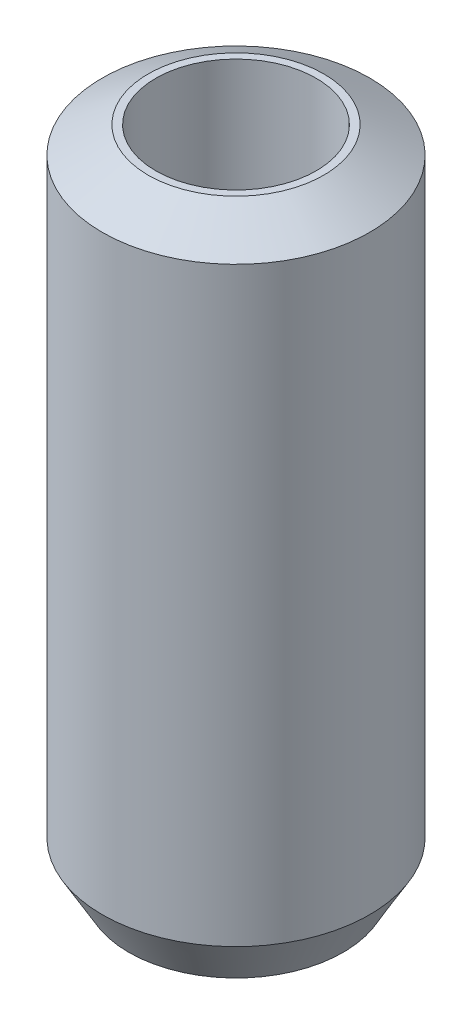
ISO-10303-21;
HEADER;
FILE_DESCRIPTION(('STEP AP214'),'2;1');
FILE_NAME('part.step','',(''),(''),'','','');
FILE_SCHEMA(('AUTOMOTIVE_DESIGN { 1 0 10303 214 1 1 1 1 }'));
ENDSEC;
DATA;
#1=APPLICATION_CONTEXT('core data for automotive mechanical design processes');
#2=APPLICATION_PROTOCOL_DEFINITION('international standard','automotive_design',2000,#1);
#3=PRODUCT_CONTEXT('',#1,'mechanical');
#4=PRODUCT('Part','Part','',(#3));
#5=PRODUCT_RELATED_PRODUCT_CATEGORY('part','',(#4));
#6=PRODUCT_DEFINITION_FORMATION('','',#4);
#7=PRODUCT_DEFINITION_CONTEXT('part definition',#1,'design');
#8=PRODUCT_DEFINITION('design','',#6,#7);
#9=PRODUCT_DEFINITION_SHAPE('','',#8);
#10=(LENGTH_UNIT() NAMED_UNIT(*) SI_UNIT(.MILLI.,.METRE.));
#11=(NAMED_UNIT(*) PLANE_ANGLE_UNIT() SI_UNIT($,.RADIAN.));
#12=(NAMED_UNIT(*) SI_UNIT($,.STERADIAN.) SOLID_ANGLE_UNIT());
#13=UNCERTAINTY_MEASURE_WITH_UNIT(LENGTH_MEASURE(1.E-05),#10,'distance_accuracy_value','');
#14=(GEOMETRIC_REPRESENTATION_CONTEXT(3) GLOBAL_UNCERTAINTY_ASSIGNED_CONTEXT((#13)) GLOBAL_UNIT_ASSIGNED_CONTEXT((#10,
#11,#12)) REPRESENTATION_CONTEXT('',''));
#15=CARTESIAN_POINT('',(0.,0.,0.));
#16=DIRECTION('',(0.,0.,1.));
#17=DIRECTION('',(1.,0.,0.));
#18=AXIS2_PLACEMENT_3D('',#15,#16,#17);
#19=CARTESIAN_POINT('',(0.,62.0072755448033,0.));
#20=DIRECTION('',(0.,-1.,0.));
#21=DIRECTION('',(0.,0.,-1.));
#22=AXIS2_PLACEMENT_3D('',#19,#20,#21);
#23=CYLINDRICAL_SURFACE('',#22,12.5);
#24=CARTESIAN_POINT('',(0.,59.5285849510241,0.));
#25=DIRECTION('',(0.,1.,0.));
#26=DIRECTION('',(0.,0.,1.));
#27=AXIS2_PLACEMENT_3D('',#24,#25,#26);
#28=CIRCLE('',#27,12.5);
#29=CARTESIAN_POINT('',(0.,59.5285849510241,12.5));
#30=VERTEX_POINT('',#29);
#31=EDGE_CURVE('E50',#30,#30,#28,.F.);
#32=ORIENTED_EDGE('',*,*,#31,.T.);
#33=EDGE_LOOP('',(#32));
#34=FACE_BOUND('',#33,.T.);
#35=CARTESIAN_POINT('',(0.,4.29321804466857,0.));
#36=DIRECTION('',(0.,1.,0.));
#37=DIRECTION('',(0.,0.,1.));
#38=AXIS2_PLACEMENT_3D('',#35,#36,#37);
#39=CIRCLE('',#38,12.5);
#40=CARTESIAN_POINT('',(0.,4.29321804466857,12.5));
#41=VERTEX_POINT('',#40);
#42=EDGE_CURVE('E51',#41,#41,#39,.T.);
#43=ORIENTED_EDGE('',*,*,#42,.T.);
#44=EDGE_LOOP('',(#43));
#45=FACE_BOUND('',#44,.T.);
#46=ADVANCED_FACE('F39',(#34,#45),#23,.T.);
#47=CARTESIAN_POINT('',(0.,62.0072755448033,0.));
#48=DIRECTION('',(0.,1.,0.));
#49=DIRECTION('',(0.,0.,1.));
#50=AXIS2_PLACEMENT_3D('',#47,#48,#49);
#51=PLANE('',#50);
#52=CARTESIAN_POINT('',(0.,62.0072755448033,0.));
#53=DIRECTION('',(0.,1.,0.));
#54=DIRECTION('',(0.,0.,1.));
#55=AXIS2_PLACEMENT_3D('',#52,#53,#54);
#56=CIRCLE('',#55,8.20678195533143);
#57=CARTESIAN_POINT('',(0.,62.0072755448033,8.20678195533143));
#58=VERTEX_POINT('',#57);
#59=EDGE_CURVE('E54',#58,#58,#56,.T.);
#60=ORIENTED_EDGE('',*,*,#59,.T.);
#61=EDGE_LOOP('',(#60));
#62=FACE_BOUND('',#61,.T.);
#63=CARTESIAN_POINT('',(0.,62.0072755448033,0.));
#64=DIRECTION('',(0.,1.,0.));
#65=DIRECTION('',(0.,0.,1.));
#66=AXIS2_PLACEMENT_3D('',#63,#64,#65);
#67=CIRCLE('',#66,7.50042200855206);
#68=CARTESIAN_POINT('',(0.,62.0072755448033,7.50042200855206));
#69=VERTEX_POINT('',#68);
#70=EDGE_CURVE('E58',#69,#69,#67,.T.);
#71=ORIENTED_EDGE('',*,*,#70,.F.);
#72=EDGE_LOOP('',(#71));
#73=FACE_BOUND('',#72,.T.);
#74=ADVANCED_FACE('F69',(#62,#73),#51,.T.);
#75=CARTESIAN_POINT('',(0.,0.,0.));
#76=DIRECTION('',(0.,1.,0.));
#77=DIRECTION('',(0.,0.,1.));
#78=AXIS2_PLACEMENT_3D('',#75,#76,#77);
#79=PLANE('',#78);
#80=CARTESIAN_POINT('',(0.,0.,0.));
#81=DIRECTION('',(0.,1.,0.));
#82=DIRECTION('',(0.,0.,1.));
#83=AXIS2_PLACEMENT_3D('',#80,#81,#82);
#84=CIRCLE('',#83,10.0213094062208);
#85=CARTESIAN_POINT('',(0.,0.,10.0213094062208));
#86=VERTEX_POINT('',#85);
#87=EDGE_CURVE('E10',#86,#86,#84,.F.);
#88=ORIENTED_EDGE('',*,*,#87,.T.);
#89=EDGE_LOOP('',(#88));
#90=FACE_BOUND('',#89,.T.);
#91=CARTESIAN_POINT('',(0.,0.,0.));
#92=DIRECTION('',(0.,1.,0.));
#93=DIRECTION('',(0.,0.,1.));
#94=AXIS2_PLACEMENT_3D('',#91,#92,#93);
#95=CIRCLE('',#94,7.50042200855206);
#96=CARTESIAN_POINT('',(0.,0.,7.50042200855206));
#97=VERTEX_POINT('',#96);
#98=EDGE_CURVE('E63',#97,#97,#95,.T.);
#99=ORIENTED_EDGE('',*,*,#98,.T.);
#100=EDGE_LOOP('',(#99));
#101=FACE_BOUND('',#100,.T.);
#102=ADVANCED_FACE('F75',(#90,#101),#79,.F.);
#103=CARTESIAN_POINT('',(0.,62.0072755448033,0.));
#104=DIRECTION('',(0.,-1.,0.));
#105=DIRECTION('',(0.,0.,-1.));
#106=AXIS2_PLACEMENT_3D('',#103,#104,#105);
#107=CYLINDRICAL_SURFACE('',#106,7.50042200855206);
#108=ORIENTED_EDGE('',*,*,#70,.T.);
#109=EDGE_LOOP('',(#108));
#110=FACE_BOUND('',#109,.T.);
#111=ORIENTED_EDGE('',*,*,#98,.F.);
#112=EDGE_LOOP('',(#111));
#113=FACE_BOUND('',#112,.T.);
#114=ADVANCED_FACE('F70',(#110,#113),#107,.F.);
#115=CARTESIAN_POINT('',(0.,62.0072755448033,0.));
#116=DIRECTION('',(0.,-1.,0.));
#117=DIRECTION('',(0.,0.,-1.));
#118=AXIS2_PLACEMENT_3D('',#115,#116,#117);
#119=CONICAL_SURFACE('',#118,8.20678195533143,1.04719755119659);
#120=ORIENTED_EDGE('',*,*,#31,.F.);
#121=EDGE_LOOP('',(#120));
#122=FACE_BOUND('',#121,.T.);
#123=ORIENTED_EDGE('',*,*,#59,.F.);
#124=EDGE_LOOP('',(#123));
#125=FACE_BOUND('',#124,.T.);
#126=ADVANCED_FACE('F81',(#122,#125),#119,.T.);
#127=CARTESIAN_POINT('',(0.,4.29321804466857,0.));
#128=DIRECTION('',(0.,1.,0.));
#129=DIRECTION('',(0.,0.,1.));
#130=AXIS2_PLACEMENT_3D('',#127,#128,#129);
#131=CONICAL_SURFACE('',#130,12.5,0.523598775598303);
#132=ORIENTED_EDGE('',*,*,#87,.F.);
#133=EDGE_LOOP('',(#132));
#134=FACE_BOUND('',#133,.T.);
#135=ORIENTED_EDGE('',*,*,#42,.F.);
#136=EDGE_LOOP('',(#135));
#137=FACE_BOUND('',#136,.T.);
#138=ADVANCED_FACE('F45',(#134,#137),#131,.T.);
#139=CLOSED_SHELL('',(#46,#74,#102,#114,#126,#138));
#140=MANIFOLD_SOLID_BREP('B2',#139);
#141=ADVANCED_BREP_SHAPE_REPRESENTATION('',(#18,#140),#14);
#142=SHAPE_DEFINITION_REPRESENTATION(#9,#141);
ENDSEC;
END-ISO-10303-21;
